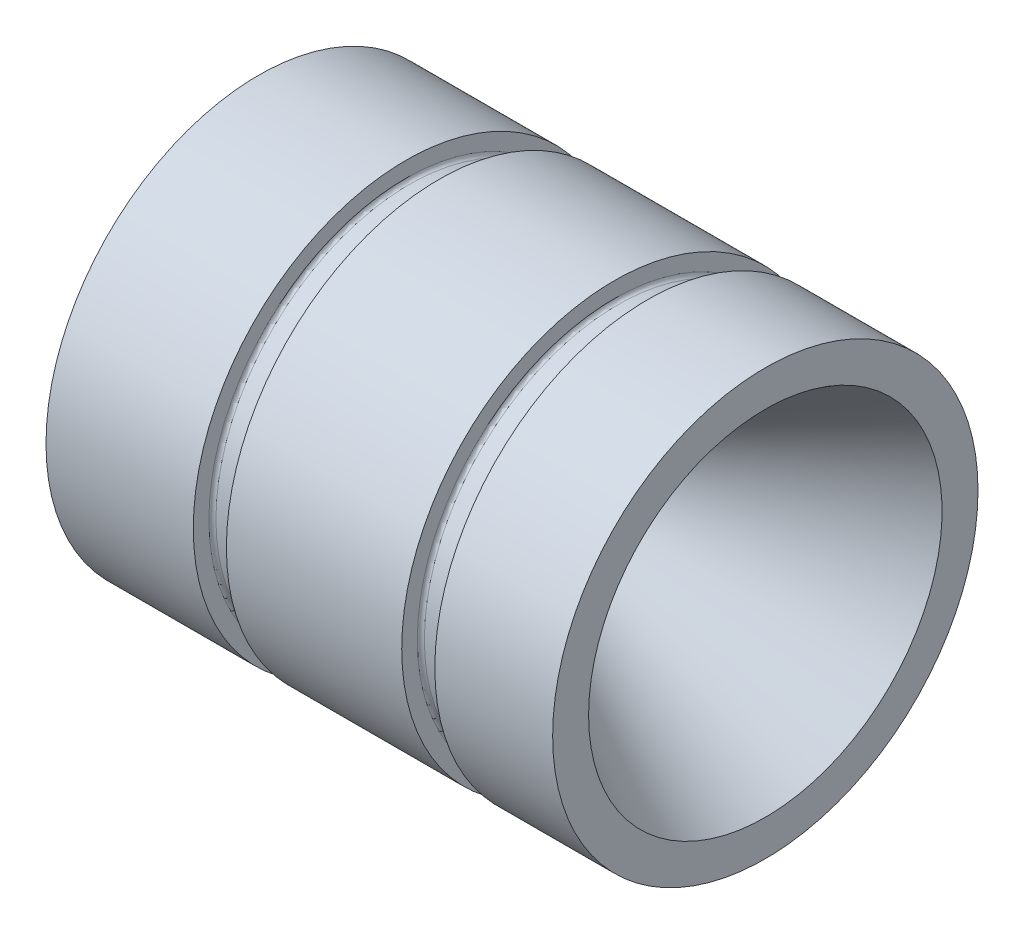
ISO-10303-21;
HEADER;
FILE_DESCRIPTION(('STEP AP214'),'2;1');
FILE_NAME('part.step','',(''),(''),'','','');
FILE_SCHEMA(('AUTOMOTIVE_DESIGN { 1 0 10303 214 1 1 1 1 }'));
ENDSEC;
DATA;
#1=APPLICATION_CONTEXT('core data for automotive mechanical design processes');
#2=APPLICATION_PROTOCOL_DEFINITION('international standard','automotive_design',2000,#1);
#3=PRODUCT_CONTEXT('',#1,'mechanical');
#4=PRODUCT('Part','Part','',(#3));
#5=PRODUCT_RELATED_PRODUCT_CATEGORY('part','',(#4));
#6=PRODUCT_DEFINITION_FORMATION('','',#4);
#7=PRODUCT_DEFINITION_CONTEXT('part definition',#1,'design');
#8=PRODUCT_DEFINITION('design','',#6,#7);
#9=PRODUCT_DEFINITION_SHAPE('','',#8);
#10=(LENGTH_UNIT() NAMED_UNIT(*) SI_UNIT(.MILLI.,.METRE.));
#11=(NAMED_UNIT(*) PLANE_ANGLE_UNIT() SI_UNIT($,.RADIAN.));
#12=(NAMED_UNIT(*) SI_UNIT($,.STERADIAN.) SOLID_ANGLE_UNIT());
#13=UNCERTAINTY_MEASURE_WITH_UNIT(LENGTH_MEASURE(1.E-05),#10,'distance_accuracy_value','');
#14=(GEOMETRIC_REPRESENTATION_CONTEXT(3) GLOBAL_UNCERTAINTY_ASSIGNED_CONTEXT((#13)) GLOBAL_UNIT_ASSIGNED_CONTEXT((#10,
#11,#12)) REPRESENTATION_CONTEXT('',''));
#15=CARTESIAN_POINT('',(0.,0.,0.));
#16=DIRECTION('',(0.,0.,1.));
#17=DIRECTION('',(1.,0.,0.));
#18=AXIS2_PLACEMENT_3D('',#15,#16,#17);
#19=CARTESIAN_POINT('',(109.22,0.,0.));
#20=DIRECTION('',(-1.,0.,0.));
#21=DIRECTION('',(0.,0.,1.));
#22=AXIS2_PLACEMENT_3D('',#19,#20,#21);
#23=CYLINDRICAL_SURFACE('',#22,45.847);
#24=CARTESIAN_POINT('',(109.22,0.,0.));
#25=DIRECTION('',(1.,0.,0.));
#26=DIRECTION('',(0.,0.,-1.));
#27=AXIS2_PLACEMENT_3D('',#24,#25,#26);
#28=CIRCLE('',#27,45.847);
#29=CARTESIAN_POINT('',(109.22,0.,-45.847));
#30=VERTEX_POINT('',#29);
#31=EDGE_CURVE('E10',#30,#30,#28,.T.);
#32=ORIENTED_EDGE('',*,*,#31,.F.);
#33=EDGE_LOOP('',(#32));
#34=FACE_BOUND('',#33,.T.);
#35=CARTESIAN_POINT('',(83.82,0.,0.));
#36=DIRECTION('',(-1.,0.,0.));
#37=DIRECTION('',(0.,0.,1.));
#38=AXIS2_PLACEMENT_3D('',#35,#36,#37);
#39=CIRCLE('',#38,45.847);
#40=CARTESIAN_POINT('',(83.82,0.,45.847));
#41=VERTEX_POINT('',#40);
#42=EDGE_CURVE('E102',#41,#41,#39,.T.);
#43=ORIENTED_EDGE('',*,*,#42,.F.);
#44=EDGE_LOOP('',(#43));
#45=FACE_BOUND('',#44,.T.);
#46=ADVANCED_FACE('F43',(#34,#45),#23,.T.);
#47=CARTESIAN_POINT('',(0.,0.,0.));
#48=DIRECTION('',(1.,0.,0.));
#49=DIRECTION('',(0.,0.,-1.));
#50=AXIS2_PLACEMENT_3D('',#47,#48,#49);
#51=CIRCLE('',#50,45.847);
#52=CARTESIAN_POINT('',(0.,0.,-45.847));
#53=VERTEX_POINT('',#52);
#54=EDGE_CURVE('E47',#53,#53,#51,.T.);
#55=ORIENTED_EDGE('',*,*,#54,.T.);
#56=EDGE_LOOP('',(#55));
#57=FACE_BOUND('',#56,.T.);
#58=CARTESIAN_POINT('',(31.75,0.,0.));
#59=DIRECTION('',(-1.,0.,0.));
#60=DIRECTION('',(0.,0.,1.));
#61=AXIS2_PLACEMENT_3D('',#58,#59,#60);
#62=CIRCLE('',#61,45.847);
#63=CARTESIAN_POINT('',(31.75,0.,45.847));
#64=VERTEX_POINT('',#63);
#65=EDGE_CURVE('E74',#64,#64,#62,.T.);
#66=ORIENTED_EDGE('',*,*,#65,.T.);
#67=EDGE_LOOP('',(#66));
#68=FACE_BOUND('',#67,.T.);
#69=ADVANCED_FACE('F135',(#57,#68),#23,.T.);
#70=CARTESIAN_POINT('',(109.22,0.,0.));
#71=DIRECTION('',(1.,0.,0.));
#72=DIRECTION('',(0.,0.,-1.));
#73=AXIS2_PLACEMENT_3D('',#70,#71,#72);
#74=PLANE('',#73);
#75=CARTESIAN_POINT('',(109.22,0.,0.));
#76=DIRECTION('',(-1.,0.,0.));
#77=DIRECTION('',(0.,0.,1.));
#78=AXIS2_PLACEMENT_3D('',#75,#76,#77);
#79=CIRCLE('',#78,38.1);
#80=CARTESIAN_POINT('',(109.22,0.,38.1));
#81=VERTEX_POINT('',#80);
#82=EDGE_CURVE('E69',#81,#81,#79,.T.);
#83=ORIENTED_EDGE('',*,*,#82,.T.);
#84=EDGE_LOOP('',(#83));
#85=FACE_BOUND('',#84,.T.);
#86=ORIENTED_EDGE('',*,*,#31,.T.);
#87=EDGE_LOOP('',(#86));
#88=FACE_BOUND('',#87,.T.);
#89=ADVANCED_FACE('F145',(#85,#88),#74,.T.);
#90=CARTESIAN_POINT('',(0.,0.,0.));
#91=DIRECTION('',(1.,0.,0.));
#92=DIRECTION('',(0.,0.,-1.));
#93=AXIS2_PLACEMENT_3D('',#90,#91,#92);
#94=PLANE('',#93);
#95=CARTESIAN_POINT('',(0.,0.,0.));
#96=DIRECTION('',(-1.,0.,0.));
#97=DIRECTION('',(0.,0.,1.));
#98=AXIS2_PLACEMENT_3D('',#95,#96,#97);
#99=CIRCLE('',#98,28.321);
#100=CARTESIAN_POINT('',(0.,0.,28.321));
#101=VERTEX_POINT('',#100);
#102=EDGE_CURVE('E56',#101,#101,#99,.T.);
#103=ORIENTED_EDGE('',*,*,#102,.F.);
#104=EDGE_LOOP('',(#103));
#105=FACE_BOUND('',#104,.T.);
#106=ORIENTED_EDGE('',*,*,#54,.F.);
#107=EDGE_LOOP('',(#106));
#108=FACE_BOUND('',#107,.T.);
#109=ADVANCED_FACE('F198',(#105,#108),#94,.F.);
#110=CARTESIAN_POINT('',(0.,0.,0.));
#111=DIRECTION('',(-1.,0.,0.));
#112=DIRECTION('',(0.,0.,1.));
#113=AXIS2_PLACEMENT_3D('',#110,#111,#112);
#114=CONICAL_SURFACE('',#113,28.321,0.261799387799143);
#115=CARTESIAN_POINT('',(58.298365665035,0.,0.));
#116=DIRECTION('',(-1.,0.,0.));
#117=DIRECTION('',(0.,0.,1.));
#118=AXIS2_PLACEMENT_3D('',#115,#116,#117);
#119=CIRCLE('',#118,12.7);
#120=CARTESIAN_POINT('',(58.298365665035,0.,12.7));
#121=VERTEX_POINT('',#120);
#122=EDGE_CURVE('E61',#121,#121,#119,.T.);
#123=ORIENTED_EDGE('',*,*,#122,.F.);
#124=EDGE_LOOP('',(#123));
#125=FACE_BOUND('',#124,.T.);
#126=ORIENTED_EDGE('',*,*,#102,.T.);
#127=EDGE_LOOP('',(#126));
#128=FACE_BOUND('',#127,.T.);
#129=ADVANCED_FACE('F194',(#125,#128),#114,.F.);
#130=CARTESIAN_POINT('',(0.,0.,0.));
#131=DIRECTION('',(-1.,0.,0.));
#132=DIRECTION('',(0.,0.,1.));
#133=AXIS2_PLACEMENT_3D('',#130,#131,#132);
#134=CYLINDRICAL_SURFACE('',#133,12.7);
#135=CARTESIAN_POINT('',(64.77,0.,0.));
#136=DIRECTION('',(-1.,0.,0.));
#137=DIRECTION('',(0.,0.,1.));
#138=AXIS2_PLACEMENT_3D('',#135,#136,#137);
#139=CIRCLE('',#138,12.7);
#140=CARTESIAN_POINT('',(64.77,0.,12.7));
#141=VERTEX_POINT('',#140);
#142=EDGE_CURVE('E65',#141,#141,#139,.T.);
#143=ORIENTED_EDGE('',*,*,#142,.F.);
#144=EDGE_LOOP('',(#143));
#145=FACE_BOUND('',#144,.T.);
#146=ORIENTED_EDGE('',*,*,#122,.T.);
#147=EDGE_LOOP('',(#146));
#148=FACE_BOUND('',#147,.T.);
#149=ADVANCED_FACE('F190',(#145,#148),#134,.F.);
#150=CARTESIAN_POINT('',(64.77,0.,0.));
#151=DIRECTION('',(1.,0.,0.));
#152=DIRECTION('',(0.,0.,-1.));
#153=AXIS2_PLACEMENT_3D('',#150,#151,#152);
#154=CONICAL_SURFACE('',#153,12.7,0.519146114246523);
#155=ORIENTED_EDGE('',*,*,#82,.F.);
#156=EDGE_LOOP('',(#155));
#157=FACE_BOUND('',#156,.T.);
#158=ORIENTED_EDGE('',*,*,#142,.T.);
#159=EDGE_LOOP('',(#158));
#160=FACE_BOUND('',#159,.T.);
#161=ADVANCED_FACE('F186',(#157,#160),#154,.F.);
#162=CARTESIAN_POINT('',(31.75,45.847,0.));
#163=DIRECTION('',(1.,0.,0.));
#164=DIRECTION('',(0.,0.,-1.));
#165=AXIS2_PLACEMENT_3D('',#162,#163,#164);
#166=PLANE('',#165);
#167=CARTESIAN_POINT('',(31.75,0.,0.));
#168=DIRECTION('',(-1.,0.,0.));
#169=DIRECTION('',(0.,0.,1.));
#170=AXIS2_PLACEMENT_3D('',#167,#168,#169);
#171=CIRCLE('',#170,42.4815);
#172=CARTESIAN_POINT('',(31.75,0.,42.4815));
#173=VERTEX_POINT('',#172);
#174=EDGE_CURVE('E95',#173,#173,#171,.T.);
#175=ORIENTED_EDGE('',*,*,#174,.T.);
#176=EDGE_LOOP('',(#175));
#177=FACE_BOUND('',#176,.T.);
#178=ORIENTED_EDGE('',*,*,#65,.F.);
#179=EDGE_LOOP('',(#178));
#180=FACE_BOUND('',#179,.T.);
#181=ADVANCED_FACE('F182',(#177,#180),#166,.T.);
#182=CARTESIAN_POINT('',(38.8874,45.847,0.));
#183=DIRECTION('',(-1.,0.,0.));
#184=DIRECTION('',(0.,0.,1.));
#185=AXIS2_PLACEMENT_3D('',#182,#183,#184);
#186=PLANE('',#185);
#187=CARTESIAN_POINT('',(38.8874,0.,0.));
#188=DIRECTION('',(-1.,0.,0.));
#189=DIRECTION('',(0.,0.,1.));
#190=AXIS2_PLACEMENT_3D('',#187,#188,#189);
#191=CIRCLE('',#190,45.847);
#192=CARTESIAN_POINT('',(38.8874,0.,45.847));
#193=VERTEX_POINT('',#192);
#194=EDGE_CURVE('E79',#193,#193,#191,.T.);
#195=ORIENTED_EDGE('',*,*,#194,.T.);
#196=EDGE_LOOP('',(#195));
#197=FACE_BOUND('',#196,.T.);
#198=CARTESIAN_POINT('',(38.8874,0.,0.));
#199=DIRECTION('',(-1.,0.,0.));
#200=DIRECTION('',(0.,0.,1.));
#201=AXIS2_PLACEMENT_3D('',#198,#199,#200);
#202=CIRCLE('',#201,42.4815);
#203=CARTESIAN_POINT('',(38.8874,0.,42.4815));
#204=VERTEX_POINT('',#203);
#205=EDGE_CURVE('E83',#204,#204,#202,.T.);
#206=ORIENTED_EDGE('',*,*,#205,.F.);
#207=EDGE_LOOP('',(#206));
#208=FACE_BOUND('',#207,.T.);
#209=ADVANCED_FACE('F178',(#197,#208),#186,.T.);
#210=CARTESIAN_POINT('',(38.1254,0.,0.));
#211=DIRECTION('',(-1.,0.,0.));
#212=DIRECTION('',(0.,0.,1.));
#213=AXIS2_PLACEMENT_3D('',#210,#211,#212);
#214=TOROIDAL_SURFACE('',#213,42.4815,0.761999999999995);
#215=ORIENTED_EDGE('',*,*,#205,.T.);
#216=EDGE_LOOP('',(#215));
#217=FACE_BOUND('',#216,.T.);
#218=CARTESIAN_POINT('',(38.1254,0.,0.));
#219=DIRECTION('',(-1.,0.,0.));
#220=DIRECTION('',(0.,0.,1.));
#221=AXIS2_PLACEMENT_3D('',#218,#219,#220);
#222=CIRCLE('',#221,41.7195);
#223=CARTESIAN_POINT('',(38.1254,0.,41.7195));
#224=VERTEX_POINT('',#223);
#225=EDGE_CURVE('E87',#224,#224,#222,.T.);
#226=ORIENTED_EDGE('',*,*,#225,.F.);
#227=EDGE_LOOP('',(#226));
#228=FACE_BOUND('',#227,.T.);
#229=ADVANCED_FACE('F174',(#217,#228),#214,.F.);
#230=CARTESIAN_POINT('',(0.,0.,0.));
#231=DIRECTION('',(-1.,0.,0.));
#232=DIRECTION('',(0.,0.,1.));
#233=AXIS2_PLACEMENT_3D('',#230,#231,#232);
#234=CYLINDRICAL_SURFACE('',#233,41.7195);
#235=ORIENTED_EDGE('',*,*,#225,.T.);
#236=EDGE_LOOP('',(#235));
#237=FACE_BOUND('',#236,.T.);
#238=CARTESIAN_POINT('',(32.512,0.,0.));
#239=DIRECTION('',(-1.,0.,0.));
#240=DIRECTION('',(0.,0.,1.));
#241=AXIS2_PLACEMENT_3D('',#238,#239,#240);
#242=CIRCLE('',#241,41.7195);
#243=CARTESIAN_POINT('',(32.512,0.,41.7195));
#244=VERTEX_POINT('',#243);
#245=EDGE_CURVE('E91',#244,#244,#242,.T.);
#246=ORIENTED_EDGE('',*,*,#245,.F.);
#247=EDGE_LOOP('',(#246));
#248=FACE_BOUND('',#247,.T.);
#249=ADVANCED_FACE('F170',(#237,#248),#234,.T.);
#250=CARTESIAN_POINT('',(32.512,0.,0.));
#251=DIRECTION('',(-1.,0.,0.));
#252=DIRECTION('',(0.,0.,1.));
#253=AXIS2_PLACEMENT_3D('',#250,#251,#252);
#254=TOROIDAL_SURFACE('',#253,42.4815,0.762000000000006);
#255=ORIENTED_EDGE('',*,*,#245,.T.);
#256=EDGE_LOOP('',(#255));
#257=FACE_BOUND('',#256,.T.);
#258=ORIENTED_EDGE('',*,*,#174,.F.);
#259=EDGE_LOOP('',(#258));
#260=FACE_BOUND('',#259,.T.);
#261=ADVANCED_FACE('F167',(#257,#260),#254,.F.);
#262=CARTESIAN_POINT('',(76.6826,45.847,0.));
#263=DIRECTION('',(1.,0.,0.));
#264=DIRECTION('',(0.,0.,-1.));
#265=AXIS2_PLACEMENT_3D('',#262,#263,#264);
#266=PLANE('',#265);
#267=CARTESIAN_POINT('',(76.6826,0.,0.));
#268=DIRECTION('',(-1.,0.,0.));
#269=DIRECTION('',(0.,0.,1.));
#270=AXIS2_PLACEMENT_3D('',#267,#268,#269);
#271=CIRCLE('',#270,42.4815);
#272=CARTESIAN_POINT('',(76.6826,0.,42.4815));
#273=VERTEX_POINT('',#272);
#274=EDGE_CURVE('E78',#273,#273,#271,.T.);
#275=ORIENTED_EDGE('',*,*,#274,.T.);
#276=EDGE_LOOP('',(#275));
#277=FACE_BOUND('',#276,.T.);
#278=CARTESIAN_POINT('',(76.6826,0.,0.));
#279=DIRECTION('',(-1.,0.,0.));
#280=DIRECTION('',(0.,0.,1.));
#281=AXIS2_PLACEMENT_3D('',#278,#279,#280);
#282=CIRCLE('',#281,45.847);
#283=CARTESIAN_POINT('',(76.6826,0.,45.847));
#284=VERTEX_POINT('',#283);
#285=EDGE_CURVE('E73',#284,#284,#282,.T.);
#286=ORIENTED_EDGE('',*,*,#285,.F.);
#287=EDGE_LOOP('',(#286));
#288=FACE_BOUND('',#287,.T.);
#289=ADVANCED_FACE('F122',(#277,#288),#266,.T.);
#290=CARTESIAN_POINT('',(83.82,45.847,0.));
#291=DIRECTION('',(-1.,0.,0.));
#292=DIRECTION('',(0.,0.,1.));
#293=AXIS2_PLACEMENT_3D('',#290,#291,#292);
#294=PLANE('',#293);
#295=ORIENTED_EDGE('',*,*,#42,.T.);
#296=EDGE_LOOP('',(#295));
#297=FACE_BOUND('',#296,.T.);
#298=CARTESIAN_POINT('',(83.82,0.,0.));
#299=DIRECTION('',(-1.,0.,0.));
#300=DIRECTION('',(0.,0.,1.));
#301=AXIS2_PLACEMENT_3D('',#298,#299,#300);
#302=CIRCLE('',#301,42.4815);
#303=CARTESIAN_POINT('',(83.82,0.,42.4815));
#304=VERTEX_POINT('',#303);
#305=EDGE_CURVE('E106',#304,#304,#302,.T.);
#306=ORIENTED_EDGE('',*,*,#305,.F.);
#307=EDGE_LOOP('',(#306));
#308=FACE_BOUND('',#307,.T.);
#309=ADVANCED_FACE('F150',(#297,#308),#294,.T.);
#310=CARTESIAN_POINT('',(83.058,0.,0.));
#311=DIRECTION('',(-1.,0.,0.));
#312=DIRECTION('',(0.,0.,1.));
#313=AXIS2_PLACEMENT_3D('',#310,#311,#312);
#314=TOROIDAL_SURFACE('',#313,42.4815,0.761999999999999);
#315=ORIENTED_EDGE('',*,*,#305,.T.);
#316=EDGE_LOOP('',(#315));
#317=FACE_BOUND('',#316,.T.);
#318=CARTESIAN_POINT('',(83.058,0.,0.));
#319=DIRECTION('',(-1.,0.,0.));
#320=DIRECTION('',(0.,0.,1.));
#321=AXIS2_PLACEMENT_3D('',#318,#319,#320);
#322=CIRCLE('',#321,41.7195);
#323=CARTESIAN_POINT('',(83.058,0.,41.7195));
#324=VERTEX_POINT('',#323);
#325=EDGE_CURVE('E110',#324,#324,#322,.T.);
#326=ORIENTED_EDGE('',*,*,#325,.F.);
#327=EDGE_LOOP('',(#326));
#328=FACE_BOUND('',#327,.T.);
#329=ADVANCED_FACE('F136',(#317,#328),#314,.F.);
#330=CARTESIAN_POINT('',(0.,0.,0.));
#331=DIRECTION('',(-1.,0.,0.));
#332=DIRECTION('',(0.,0.,1.));
#333=AXIS2_PLACEMENT_3D('',#330,#331,#332);
#334=CYLINDRICAL_SURFACE('',#333,41.7195);
#335=ORIENTED_EDGE('',*,*,#325,.T.);
#336=EDGE_LOOP('',(#335));
#337=FACE_BOUND('',#336,.T.);
#338=CARTESIAN_POINT('',(77.4446,0.,0.));
#339=DIRECTION('',(-1.,0.,0.));
#340=DIRECTION('',(0.,0.,1.));
#341=AXIS2_PLACEMENT_3D('',#338,#339,#340);
#342=CIRCLE('',#341,41.7195);
#343=CARTESIAN_POINT('',(77.4446,0.,41.7195));
#344=VERTEX_POINT('',#343);
#345=EDGE_CURVE('E114',#344,#344,#342,.T.);
#346=ORIENTED_EDGE('',*,*,#345,.F.);
#347=EDGE_LOOP('',(#346));
#348=FACE_BOUND('',#347,.T.);
#349=ADVANCED_FACE('F127',(#337,#348),#334,.T.);
#350=CARTESIAN_POINT('',(77.4446,0.,0.));
#351=DIRECTION('',(-1.,0.,0.));
#352=DIRECTION('',(0.,0.,1.));
#353=AXIS2_PLACEMENT_3D('',#350,#351,#352);
#354=TOROIDAL_SURFACE('',#353,42.4815,0.761999999999999);
#355=ORIENTED_EDGE('',*,*,#345,.T.);
#356=EDGE_LOOP('',(#355));
#357=FACE_BOUND('',#356,.T.);
#358=ORIENTED_EDGE('',*,*,#274,.F.);
#359=EDGE_LOOP('',(#358));
#360=FACE_BOUND('',#359,.T.);
#361=ADVANCED_FACE('F125',(#357,#360),#354,.F.);
#362=ORIENTED_EDGE('',*,*,#194,.F.);
#363=EDGE_LOOP('',(#362));
#364=FACE_BOUND('',#363,.T.);
#365=ORIENTED_EDGE('',*,*,#285,.T.);
#366=EDGE_LOOP('',(#365));
#367=FACE_BOUND('',#366,.T.);
#368=ADVANCED_FACE('F45',(#364,#367),#23,.T.);
#369=CLOSED_SHELL('',(#46,#69,#89,#109,#129,#149,#161,#181,#209,#229,#249,#261,#289,#309,#329,
#349,#361,#368));
#370=MANIFOLD_SOLID_BREP('B2',#369);
#371=ADVANCED_BREP_SHAPE_REPRESENTATION('',(#18,#370),#14);
#372=SHAPE_DEFINITION_REPRESENTATION(#9,#371);
ENDSEC;
END-ISO-10303-21;
